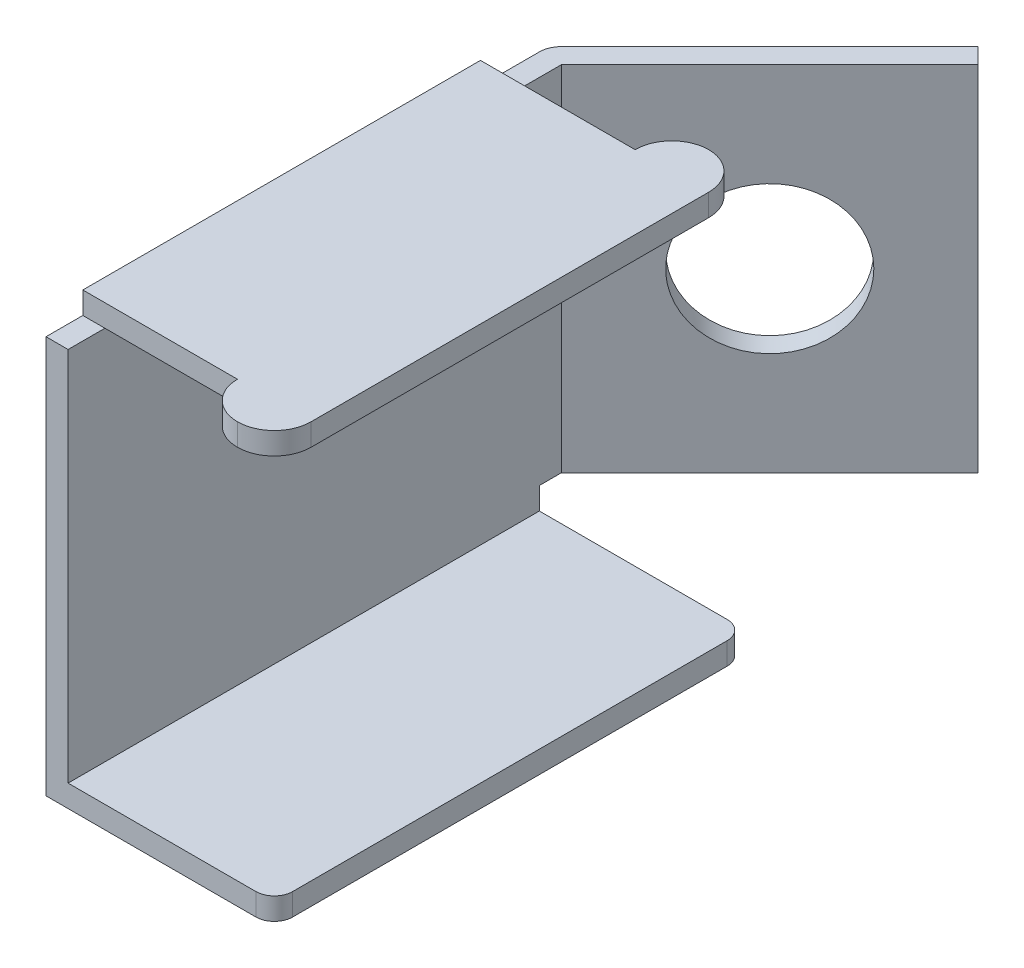
ISO-10303-21;
HEADER;
FILE_DESCRIPTION(('STEP AP214'),'2;1');
FILE_NAME('part.step','',(''),(''),'','','');
FILE_SCHEMA(('AUTOMOTIVE_DESIGN { 1 0 10303 214 1 1 1 1 }'));
ENDSEC;
DATA;
#1=APPLICATION_CONTEXT('core data for automotive mechanical design processes');
#2=APPLICATION_PROTOCOL_DEFINITION('international standard','automotive_design',2000,#1);
#3=PRODUCT_CONTEXT('',#1,'mechanical');
#4=PRODUCT('Part','Part','',(#3));
#5=PRODUCT_RELATED_PRODUCT_CATEGORY('part','',(#4));
#6=PRODUCT_DEFINITION_FORMATION('','',#4);
#7=PRODUCT_DEFINITION_CONTEXT('part definition',#1,'design');
#8=PRODUCT_DEFINITION('design','',#6,#7);
#9=PRODUCT_DEFINITION_SHAPE('','',#8);
#10=(LENGTH_UNIT() NAMED_UNIT(*) SI_UNIT(.MILLI.,.METRE.));
#11=(NAMED_UNIT(*) PLANE_ANGLE_UNIT() SI_UNIT($,.RADIAN.));
#12=(NAMED_UNIT(*) SI_UNIT($,.STERADIAN.) SOLID_ANGLE_UNIT());
#13=UNCERTAINTY_MEASURE_WITH_UNIT(LENGTH_MEASURE(1.E-05),#10,'distance_accuracy_value','');
#14=(GEOMETRIC_REPRESENTATION_CONTEXT(3) GLOBAL_UNCERTAINTY_ASSIGNED_CONTEXT((#13)) GLOBAL_UNIT_ASSIGNED_CONTEXT((#10,
#11,#12)) REPRESENTATION_CONTEXT('',''));
#15=CARTESIAN_POINT('',(0.,0.,0.));
#16=DIRECTION('',(0.,0.,1.));
#17=DIRECTION('',(1.,0.,0.));
#18=AXIS2_PLACEMENT_3D('',#15,#16,#17);
#19=CARTESIAN_POINT('',(0.,2.7,0.));
#20=DIRECTION('',(0.,1.,0.));
#21=DIRECTION('',(0.,0.,1.));
#22=AXIS2_PLACEMENT_3D('',#19,#20,#21);
#23=PLANE('',#22);
#24=DIRECTION('',(-1.,0.,0.));
#25=VECTOR('',#24,1.);
#26=CARTESIAN_POINT('',(0.,2.7,-1.35000000000001));
#27=LINE('',#26,#25);
#28=CARTESIAN_POINT('',(0.15,2.7,-1.35000000000001));
#29=VERTEX_POINT('',#28);
#30=CARTESIAN_POINT('',(0.,2.7,-1.35000000000001));
#31=VERTEX_POINT('',#30);
#32=EDGE_CURVE('E376',#29,#31,#27,.T.);
#33=ORIENTED_EDGE('',*,*,#32,.F.);
#34=DIRECTION('',(0.,0.,-1.));
#35=VECTOR('',#34,1.);
#36=CARTESIAN_POINT('',(0.15,2.7,-1.6));
#37=LINE('',#36,#35);
#38=CARTESIAN_POINT('',(0.150000000000001,2.7,-1.75000000000001));
#39=VERTEX_POINT('',#38);
#40=EDGE_CURVE('E300',#29,#39,#37,.T.);
#41=ORIENTED_EDGE('',*,*,#40,.T.);
#42=DIRECTION('',(0.707106781186551,0.,-0.707106781186544));
#43=VECTOR('',#42,1.);
#44=CARTESIAN_POINT('',(0.150000000000001,2.7,-1.75000000000001));
#45=LINE('',#44,#43);
#46=CARTESIAN_POINT('',(1.5642135623731,2.7,-3.16421356237309));
#47=VERTEX_POINT('',#46);
#48=EDGE_CURVE('E233',#39,#47,#45,.T.);
#49=ORIENTED_EDGE('',*,*,#48,.T.);
#50=DIRECTION('',(-0.707106781186543,0.,-0.707106781186552));
#51=VECTOR('',#50,1.);
#52=CARTESIAN_POINT('',(1.5642135623731,2.7,-3.16421356237309));
#53=LINE('',#52,#51);
#54=CARTESIAN_POINT('',(1.45814754519512,2.7,-3.27027957955108));
#55=VERTEX_POINT('',#54);
#56=EDGE_CURVE('E255',#47,#55,#53,.T.);
#57=ORIENTED_EDGE('',*,*,#56,.T.);
#58=DIRECTION('',(-0.707106781186551,0.,0.707106781186544));
#59=VECTOR('',#58,1.);
#60=CARTESIAN_POINT('',(1.45814754519512,2.7,-3.27027957955108));
#61=LINE('',#60,#59);
#62=CARTESIAN_POINT('',(0.0439339828220191,2.7,-1.85606601717799));
#63=VERTEX_POINT('',#62);
#64=EDGE_CURVE('E259',#55,#63,#61,.T.);
#65=ORIENTED_EDGE('',*,*,#64,.T.);
#66=CARTESIAN_POINT('',(0.150000000000002,2.7,-1.75000000000001));
#67=DIRECTION('',(0.,1.,0.));
#68=DIRECTION('',(0.,0.,1.));
#69=AXIS2_PLACEMENT_3D('',#66,#67,#68);
#70=CIRCLE('',#69,0.150000000000002);
#71=CARTESIAN_POINT('',(0.,2.7,-1.75000000000001));
#72=VERTEX_POINT('',#71);
#73=EDGE_CURVE('E239',#63,#72,#70,.T.);
#74=ORIENTED_EDGE('',*,*,#73,.T.);
#75=DIRECTION('',(0.,0.,1.));
#76=VECTOR('',#75,1.);
#77=CARTESIAN_POINT('',(0.,2.7,-1.6));
#78=LINE('',#77,#76);
#79=EDGE_CURVE('E293',#72,#31,#78,.T.);
#80=ORIENTED_EDGE('',*,*,#79,.T.);
#81=EDGE_LOOP('',(#33,#41,#49,#57,#65,#74,#80));
#82=FACE_BOUND('',#81,.T.);
#83=ADVANCED_FACE('F39',(#82),#23,.T.);
#84=CARTESIAN_POINT('',(0.,0.15,-1.60000000000001));
#85=DIRECTION('',(0.,0.,1.));
#86=DIRECTION('',(1.,0.,0.));
#87=AXIS2_PLACEMENT_3D('',#84,#85,#86);
#88=PLANE('',#87);
#89=DIRECTION('',(-1.,0.,0.));
#90=VECTOR('',#89,1.);
#91=CARTESIAN_POINT('',(0.15,0.3,-1.60000000000001));
#92=LINE('',#91,#90);
#93=CARTESIAN_POINT('',(0.15,0.3,-1.60000000000001));
#94=VERTEX_POINT('',#93);
#95=CARTESIAN_POINT('',(0.,0.3,-1.60000000000001));
#96=VERTEX_POINT('',#95);
#97=EDGE_CURVE('E269',#94,#96,#92,.T.);
#98=ORIENTED_EDGE('',*,*,#97,.F.);
#99=DIRECTION('',(0.,-1.,0.));
#100=VECTOR('',#99,1.);
#101=CARTESIAN_POINT('',(0.15,2.7,-1.6));
#102=LINE('',#101,#100);
#103=CARTESIAN_POINT('',(0.15,0.15,-1.6));
#104=VERTEX_POINT('',#103);
#105=EDGE_CURVE('E304',#94,#104,#102,.T.);
#106=ORIENTED_EDGE('',*,*,#105,.T.);
#107=DIRECTION('',(-1.,0.,0.));
#108=VECTOR('',#107,1.);
#109=CARTESIAN_POINT('',(0.,0.15,-1.60000000000001));
#110=LINE('',#109,#108);
#111=CARTESIAN_POINT('',(1.42500000000001,0.15,-1.6));
#112=VERTEX_POINT('',#111);
#113=EDGE_CURVE('E324',#112,#104,#110,.T.);
#114=ORIENTED_EDGE('',*,*,#113,.F.);
#115=DIRECTION('',(0.,-1.,0.));
#116=VECTOR('',#115,1.);
#117=CARTESIAN_POINT('',(1.42500000000001,0.15,-1.6));
#118=LINE('',#117,#116);
#119=CARTESIAN_POINT('',(1.42500000000001,0.,-1.6));
#120=VERTEX_POINT('',#119);
#121=EDGE_CURVE('E372',#112,#120,#118,.T.);
#122=ORIENTED_EDGE('',*,*,#121,.T.);
#123=DIRECTION('',(-1.,0.,0.));
#124=VECTOR('',#123,1.);
#125=CARTESIAN_POINT('',(0.,0.,-1.60000000000001));
#126=LINE('',#125,#124);
#127=CARTESIAN_POINT('',(0.,0.,-1.60000000000001));
#128=VERTEX_POINT('',#127);
#129=EDGE_CURVE('E320',#120,#128,#126,.T.);
#130=ORIENTED_EDGE('',*,*,#129,.T.);
#131=DIRECTION('',(0.,-1.,0.));
#132=VECTOR('',#131,1.);
#133=CARTESIAN_POINT('',(0.,0.15,-1.60000000000001));
#134=LINE('',#133,#132);
#135=EDGE_CURVE('E328',#96,#128,#134,.T.);
#136=ORIENTED_EDGE('',*,*,#135,.F.);
#137=EDGE_LOOP('',(#98,#106,#114,#122,#130,#136));
#138=FACE_BOUND('',#137,.T.);
#139=ADVANCED_FACE('F483',(#138),#88,.F.);
#140=CARTESIAN_POINT('',(0.,0.15,-1.60000000000001));
#141=DIRECTION('',(1.,0.,0.));
#142=DIRECTION('',(0.,0.,-1.));
#143=AXIS2_PLACEMENT_3D('',#140,#141,#142);
#144=PLANE('',#143);
#145=DIRECTION('',(0.,0.,1.));
#146=VECTOR('',#145,1.);
#147=CARTESIAN_POINT('',(0.,0.,-1.60000000000001));
#148=LINE('',#147,#146);
#149=CARTESIAN_POINT('',(0.,0.,1.60000000000001));
#150=VERTEX_POINT('',#149);
#151=EDGE_CURVE('E315',#128,#150,#148,.T.);
#152=ORIENTED_EDGE('',*,*,#151,.T.);
#153=DIRECTION('',(0.,-1.,0.));
#154=VECTOR('',#153,1.);
#155=CARTESIAN_POINT('',(0.,0.15,1.60000000000001));
#156=LINE('',#155,#154);
#157=CARTESIAN_POINT('',(0.,2.7,1.60000000000001));
#158=VERTEX_POINT('',#157);
#159=EDGE_CURVE('E345',#158,#150,#156,.T.);
#160=ORIENTED_EDGE('',*,*,#159,.F.);
#161=CARTESIAN_POINT('',(0.,2.7,1.35000000000001));
#162=VERTEX_POINT('',#161);
#163=EDGE_CURVE('E297',#162,#158,#78,.T.);
#164=ORIENTED_EDGE('',*,*,#163,.F.);
#165=DIRECTION('',(0.,-1.,0.));
#166=VECTOR('',#165,1.);
#167=CARTESIAN_POINT('',(0.,2.85,1.35000000000001));
#168=LINE('',#167,#166);
#169=CARTESIAN_POINT('',(0.,2.85,1.35000000000001));
#170=VERTEX_POINT('',#169);
#171=EDGE_CURVE('E214',#170,#162,#168,.T.);
#172=ORIENTED_EDGE('',*,*,#171,.F.);
#173=DIRECTION('',(0.,0.,1.));
#174=VECTOR('',#173,1.);
#175=CARTESIAN_POINT('',(0.,2.85,1.35000000000001));
#176=LINE('',#175,#174);
#177=CARTESIAN_POINT('',(0.,2.85,-1.35000000000001));
#178=VERTEX_POINT('',#177);
#179=EDGE_CURVE('E437',#178,#170,#176,.T.);
#180=ORIENTED_EDGE('',*,*,#179,.F.);
#181=DIRECTION('',(0.,-1.,0.));
#182=VECTOR('',#181,1.);
#183=CARTESIAN_POINT('',(0.,2.85,-1.35000000000001));
#184=LINE('',#183,#182);
#185=EDGE_CURVE('E222',#178,#31,#184,.T.);
#186=ORIENTED_EDGE('',*,*,#185,.T.);
#187=ORIENTED_EDGE('',*,*,#79,.F.);
#188=DIRECTION('',(0.,1.,0.));
#189=VECTOR('',#188,1.);
#190=CARTESIAN_POINT('',(0.,2.7,-1.75000000000001));
#191=LINE('',#190,#189);
#192=CARTESIAN_POINT('',(0.,0.3,-1.75000000000001));
#193=VERTEX_POINT('',#192);
#194=EDGE_CURVE('E279',#193,#72,#191,.T.);
#195=ORIENTED_EDGE('',*,*,#194,.F.);
#196=DIRECTION('',(0.,0.,1.));
#197=VECTOR('',#196,1.);
#198=CARTESIAN_POINT('',(0.,0.3,-1.75000000000001));
#199=LINE('',#198,#197);
#200=EDGE_CURVE('E283',#193,#96,#199,.T.);
#201=ORIENTED_EDGE('',*,*,#200,.T.);
#202=ORIENTED_EDGE('',*,*,#135,.T.);
#203=EDGE_LOOP('',(#152,#160,#164,#172,#180,#186,#187,#195,#201,#202));
#204=FACE_BOUND('',#203,.T.);
#205=ADVANCED_FACE('F446',(#204),#144,.F.);
#206=CARTESIAN_POINT('',(0.,0.15,1.60000000000001));
#207=DIRECTION('',(0.,0.,-1.));
#208=DIRECTION('',(-1.,0.,0.));
#209=AXIS2_PLACEMENT_3D('',#206,#207,#208);
#210=PLANE('',#209);
#211=DIRECTION('',(1.,0.,0.));
#212=VECTOR('',#211,1.);
#213=CARTESIAN_POINT('',(0.,0.,1.60000000000001));
#214=LINE('',#213,#212);
#215=CARTESIAN_POINT('',(1.425,0.,1.6));
#216=VERTEX_POINT('',#215);
#217=EDGE_CURVE('E332',#150,#216,#214,.T.);
#218=ORIENTED_EDGE('',*,*,#217,.T.);
#219=DIRECTION('',(0.,-1.,0.));
#220=VECTOR('',#219,1.);
#221=CARTESIAN_POINT('',(1.425,0.15,1.6));
#222=LINE('',#221,#220);
#223=CARTESIAN_POINT('',(1.425,0.15,1.6));
#224=VERTEX_POINT('',#223);
#225=EDGE_CURVE('E362',#216,#224,#222,.F.);
#226=ORIENTED_EDGE('',*,*,#225,.T.);
#227=DIRECTION('',(1.,0.,0.));
#228=VECTOR('',#227,1.);
#229=CARTESIAN_POINT('',(0.,0.15,1.60000000000001));
#230=LINE('',#229,#228);
#231=CARTESIAN_POINT('',(0.15,0.15,1.60000000000001));
#232=VERTEX_POINT('',#231);
#233=EDGE_CURVE('E316',#232,#224,#230,.T.);
#234=ORIENTED_EDGE('',*,*,#233,.F.);
#235=DIRECTION('',(0.,-1.,0.));
#236=VECTOR('',#235,1.);
#237=CARTESIAN_POINT('',(0.15,2.7,1.60000000000001));
#238=LINE('',#237,#236);
#239=CARTESIAN_POINT('',(0.15,2.7,1.60000000000001));
#240=VERTEX_POINT('',#239);
#241=EDGE_CURVE('E311',#240,#232,#238,.T.);
#242=ORIENTED_EDGE('',*,*,#241,.F.);
#243=DIRECTION('',(1.,0.,0.));
#244=VECTOR('',#243,1.);
#245=CARTESIAN_POINT('',(0.,2.7,1.60000000000001));
#246=LINE('',#245,#244);
#247=EDGE_CURVE('E296',#158,#240,#246,.T.);
#248=ORIENTED_EDGE('',*,*,#247,.F.);
#249=ORIENTED_EDGE('',*,*,#159,.T.);
#250=EDGE_LOOP('',(#218,#226,#234,#242,#248,#249));
#251=FACE_BOUND('',#250,.T.);
#252=ADVANCED_FACE('F493',(#251),#210,.F.);
#253=CARTESIAN_POINT('',(1.55000000000001,0.15,-1.6));
#254=DIRECTION('',(-1.,0.,0.));
#255=DIRECTION('',(0.,0.,1.));
#256=AXIS2_PLACEMENT_3D('',#253,#254,#255);
#257=PLANE('',#256);
#258=DIRECTION('',(0.,0.,-1.));
#259=VECTOR('',#258,1.);
#260=CARTESIAN_POINT('',(1.55000000000001,0.15,-1.6));
#261=LINE('',#260,#259);
#262=CARTESIAN_POINT('',(1.55,0.15,1.475));
#263=VERTEX_POINT('',#262);
#264=CARTESIAN_POINT('',(1.55000000000001,0.15,-1.475));
#265=VERTEX_POINT('',#264);
#266=EDGE_CURVE('E319',#263,#265,#261,.T.);
#267=ORIENTED_EDGE('',*,*,#266,.F.);
#268=DIRECTION('',(0.,-1.,0.));
#269=VECTOR('',#268,1.);
#270=CARTESIAN_POINT('',(1.55,0.15,1.475));
#271=LINE('',#270,#269);
#272=CARTESIAN_POINT('',(1.55,0.,1.475));
#273=VERTEX_POINT('',#272);
#274=EDGE_CURVE('E352',#263,#273,#271,.T.);
#275=ORIENTED_EDGE('',*,*,#274,.T.);
#276=DIRECTION('',(0.,0.,-1.));
#277=VECTOR('',#276,1.);
#278=CARTESIAN_POINT('',(1.55000000000001,0.,-1.6));
#279=LINE('',#278,#277);
#280=CARTESIAN_POINT('',(1.55000000000001,0.,-1.475));
#281=VERTEX_POINT('',#280);
#282=EDGE_CURVE('E336',#273,#281,#279,.T.);
#283=ORIENTED_EDGE('',*,*,#282,.T.);
#284=DIRECTION('',(0.,-1.,0.));
#285=VECTOR('',#284,1.);
#286=CARTESIAN_POINT('',(1.55000000000001,0.15,-1.475));
#287=LINE('',#286,#285);
#288=EDGE_CURVE('E349',#281,#265,#287,.F.);
#289=ORIENTED_EDGE('',*,*,#288,.T.);
#290=EDGE_LOOP('',(#267,#275,#283,#289));
#291=FACE_BOUND('',#290,.T.);
#292=ADVANCED_FACE('F507',(#291),#257,.F.);
#293=CARTESIAN_POINT('',(0.,0.15,0.));
#294=DIRECTION('',(0.,1.,0.));
#295=DIRECTION('',(0.,0.,1.));
#296=AXIS2_PLACEMENT_3D('',#293,#294,#295);
#297=PLANE('',#296);
#298=DIRECTION('',(0.,0.,-1.));
#299=VECTOR('',#298,1.);
#300=CARTESIAN_POINT('',(0.15,0.15,-1.6));
#301=LINE('',#300,#299);
#302=EDGE_CURVE('E292',#232,#104,#301,.T.);
#303=ORIENTED_EDGE('',*,*,#302,.F.);
#304=ORIENTED_EDGE('',*,*,#233,.T.);
#305=CARTESIAN_POINT('',(1.425,0.15,1.475));
#306=DIRECTION('',(0.,1.,0.));
#307=DIRECTION('',(0.,0.,1.));
#308=AXIS2_PLACEMENT_3D('',#305,#306,#307);
#309=CIRCLE('',#308,0.125);
#310=EDGE_CURVE('E369',#224,#263,#309,.T.);
#311=ORIENTED_EDGE('',*,*,#310,.T.);
#312=ORIENTED_EDGE('',*,*,#266,.T.);
#313=CARTESIAN_POINT('',(1.42500000000001,0.15,-1.475));
#314=DIRECTION('',(0.,1.,0.));
#315=DIRECTION('',(0.,0.,1.));
#316=AXIS2_PLACEMENT_3D('',#313,#314,#315);
#317=CIRCLE('',#316,0.125);
#318=EDGE_CURVE('E366',#265,#112,#317,.T.);
#319=ORIENTED_EDGE('',*,*,#318,.T.);
#320=ORIENTED_EDGE('',*,*,#113,.T.);
#321=EDGE_LOOP('',(#303,#304,#311,#312,#319,#320));
#322=FACE_BOUND('',#321,.T.);
#323=ADVANCED_FACE('F499',(#322),#297,.T.);
#324=CARTESIAN_POINT('',(0.,0.,0.));
#325=DIRECTION('',(0.,1.,0.));
#326=DIRECTION('',(0.,0.,1.));
#327=AXIS2_PLACEMENT_3D('',#324,#325,#326);
#328=PLANE('',#327);
#329=ORIENTED_EDGE('',*,*,#282,.F.);
#330=CARTESIAN_POINT('',(1.425,0.,1.475));
#331=DIRECTION('',(0.,1.,0.));
#332=DIRECTION('',(0.,0.,1.));
#333=AXIS2_PLACEMENT_3D('',#330,#331,#332);
#334=CIRCLE('',#333,0.125);
#335=EDGE_CURVE('E359',#273,#216,#334,.F.);
#336=ORIENTED_EDGE('',*,*,#335,.T.);
#337=ORIENTED_EDGE('',*,*,#217,.F.);
#338=ORIENTED_EDGE('',*,*,#151,.F.);
#339=ORIENTED_EDGE('',*,*,#129,.F.);
#340=CARTESIAN_POINT('',(1.42500000000001,0.,-1.475));
#341=DIRECTION('',(0.,1.,0.));
#342=DIRECTION('',(0.,0.,1.));
#343=AXIS2_PLACEMENT_3D('',#340,#341,#342);
#344=CIRCLE('',#343,0.125);
#345=EDGE_CURVE('E356',#120,#281,#344,.F.);
#346=ORIENTED_EDGE('',*,*,#345,.T.);
#347=EDGE_LOOP('',(#329,#336,#337,#338,#339,#346));
#348=FACE_BOUND('',#347,.T.);
#349=ADVANCED_FACE('F490',(#348),#328,.F.);
#350=CARTESIAN_POINT('',(1.425,0.15,1.475));
#351=DIRECTION('',(0.,-1.,0.));
#352=DIRECTION('',(0.,0.,-1.));
#353=AXIS2_PLACEMENT_3D('',#350,#351,#352);
#354=CYLINDRICAL_SURFACE('',#353,0.125);
#355=ORIENTED_EDGE('',*,*,#310,.F.);
#356=ORIENTED_EDGE('',*,*,#225,.F.);
#357=ORIENTED_EDGE('',*,*,#335,.F.);
#358=ORIENTED_EDGE('',*,*,#274,.F.);
#359=EDGE_LOOP('',(#355,#356,#357,#358));
#360=FACE_BOUND('',#359,.T.);
#361=ADVANCED_FACE('F503',(#360),#354,.T.);
#362=CARTESIAN_POINT('',(1.42500000000001,0.15,-1.475));
#363=DIRECTION('',(0.,-1.,0.));
#364=DIRECTION('',(0.,0.,-1.));
#365=AXIS2_PLACEMENT_3D('',#362,#363,#364);
#366=CYLINDRICAL_SURFACE('',#365,0.125);
#367=ORIENTED_EDGE('',*,*,#318,.F.);
#368=ORIENTED_EDGE('',*,*,#288,.F.);
#369=ORIENTED_EDGE('',*,*,#345,.F.);
#370=ORIENTED_EDGE('',*,*,#121,.F.);
#371=EDGE_LOOP('',(#367,#368,#369,#370));
#372=FACE_BOUND('',#371,.T.);
#373=ADVANCED_FACE('F510',(#372),#366,.T.);
#374=CARTESIAN_POINT('',(0.15,2.7,-1.6));
#375=DIRECTION('',(-1.,0.,0.));
#376=DIRECTION('',(0.,0.,1.));
#377=AXIS2_PLACEMENT_3D('',#374,#375,#376);
#378=PLANE('',#377);
#379=ORIENTED_EDGE('',*,*,#302,.T.);
#380=ORIENTED_EDGE('',*,*,#105,.F.);
#381=DIRECTION('',(0.,0.,1.));
#382=VECTOR('',#381,1.);
#383=CARTESIAN_POINT('',(0.15,0.3,-1.75000000000001));
#384=LINE('',#383,#382);
#385=CARTESIAN_POINT('',(0.15,0.3,-1.75000000000001));
#386=VERTEX_POINT('',#385);
#387=EDGE_CURVE('E289',#386,#94,#384,.T.);
#388=ORIENTED_EDGE('',*,*,#387,.F.);
#389=DIRECTION('',(0.,-1.,0.));
#390=VECTOR('',#389,1.);
#391=CARTESIAN_POINT('',(0.150000000000001,2.7,-1.75000000000001));
#392=LINE('',#391,#390);
#393=EDGE_CURVE('E275',#39,#386,#392,.T.);
#394=ORIENTED_EDGE('',*,*,#393,.F.);
#395=ORIENTED_EDGE('',*,*,#40,.F.);
#396=CARTESIAN_POINT('',(0.15,2.7,1.35000000000001));
#397=VERTEX_POINT('',#396);
#398=EDGE_CURVE('E305',#397,#29,#37,.T.);
#399=ORIENTED_EDGE('',*,*,#398,.F.);
#400=EDGE_CURVE('E301',#240,#397,#37,.T.);
#401=ORIENTED_EDGE('',*,*,#400,.F.);
#402=ORIENTED_EDGE('',*,*,#241,.T.);
#403=EDGE_LOOP('',(#379,#380,#388,#394,#395,#399,#401,#402));
#404=FACE_BOUND('',#403,.T.);
#405=ADVANCED_FACE('F464',(#404),#378,.F.);
#406=DIRECTION('',(1.,0.,0.));
#407=VECTOR('',#406,1.);
#408=CARTESIAN_POINT('',(0.,2.7,1.35000000000001));
#409=LINE('',#408,#407);
#410=EDGE_CURVE('E206',#162,#397,#409,.T.);
#411=ORIENTED_EDGE('',*,*,#410,.F.);
#412=ORIENTED_EDGE('',*,*,#163,.T.);
#413=ORIENTED_EDGE('',*,*,#247,.T.);
#414=ORIENTED_EDGE('',*,*,#400,.T.);
#415=EDGE_LOOP('',(#411,#412,#413,#414));
#416=FACE_BOUND('',#415,.T.);
#417=ADVANCED_FACE('F497',(#416),#23,.T.);
#418=CARTESIAN_POINT('',(0.15,0.3,-1.75000000000001));
#419=DIRECTION('',(0.,1.,0.));
#420=DIRECTION('',(0.,0.,1.));
#421=AXIS2_PLACEMENT_3D('',#418,#419,#420);
#422=PLANE('',#421);
#423=ORIENTED_EDGE('',*,*,#97,.T.);
#424=ORIENTED_EDGE('',*,*,#200,.F.);
#425=CARTESIAN_POINT('',(0.150000000000002,0.3,-1.75000000000001));
#426=DIRECTION('',(0.,1.,0.));
#427=DIRECTION('',(0.,0.,1.));
#428=AXIS2_PLACEMENT_3D('',#425,#426,#427);
#429=CIRCLE('',#428,0.150000000000002);
#430=CARTESIAN_POINT('',(0.0439339828220191,0.3,-1.85606601717799));
#431=VERTEX_POINT('',#430);
#432=EDGE_CURVE('E247',#431,#193,#429,.T.);
#433=ORIENTED_EDGE('',*,*,#432,.F.);
#434=DIRECTION('',(-0.707106781186551,0.,0.707106781186544));
#435=VECTOR('',#434,1.);
#436=CARTESIAN_POINT('',(1.45814754519512,0.3,-3.27027957955108));
#437=LINE('',#436,#435);
#438=CARTESIAN_POINT('',(1.45814754519512,0.3,-3.27027957955108));
#439=VERTEX_POINT('',#438);
#440=EDGE_CURVE('E243',#439,#431,#437,.T.);
#441=ORIENTED_EDGE('',*,*,#440,.F.);
#442=DIRECTION('',(-0.707106781186543,0.,-0.707106781186552));
#443=VECTOR('',#442,1.);
#444=CARTESIAN_POINT('',(1.5642135623731,0.3,-3.16421356237309));
#445=LINE('',#444,#443);
#446=CARTESIAN_POINT('',(1.5642135623731,0.3,-3.16421356237309));
#447=VERTEX_POINT('',#446);
#448=EDGE_CURVE('E238',#447,#439,#445,.T.);
#449=ORIENTED_EDGE('',*,*,#448,.F.);
#450=DIRECTION('',(0.707106781186551,0.,-0.707106781186544));
#451=VECTOR('',#450,1.);
#452=CARTESIAN_POINT('',(0.150000000000001,0.3,-1.75000000000001));
#453=LINE('',#452,#451);
#454=EDGE_CURVE('E234',#386,#447,#453,.T.);
#455=ORIENTED_EDGE('',*,*,#454,.F.);
#456=ORIENTED_EDGE('',*,*,#387,.T.);
#457=EDGE_LOOP('',(#423,#424,#433,#441,#449,#455,#456));
#458=FACE_BOUND('',#457,.T.);
#459=ADVANCED_FACE('F528',(#458),#422,.F.);
#460=CARTESIAN_POINT('',(0.150000000000002,0.3,-1.75000000000001));
#461=DIRECTION('',(0.,1.,0.));
#462=DIRECTION('',(0.,0.,1.));
#463=AXIS2_PLACEMENT_3D('',#460,#461,#462);
#464=CYLINDRICAL_SURFACE('',#463,0.150000000000002);
#465=ORIENTED_EDGE('',*,*,#73,.F.);
#466=DIRECTION('',(0.,1.,0.));
#467=VECTOR('',#466,1.);
#468=CARTESIAN_POINT('',(0.0439339828220191,0.3,-1.85606601717799));
#469=LINE('',#468,#467);
#470=EDGE_CURVE('E266',#431,#63,#469,.T.);
#471=ORIENTED_EDGE('',*,*,#470,.F.);
#472=ORIENTED_EDGE('',*,*,#432,.T.);
#473=ORIENTED_EDGE('',*,*,#194,.T.);
#474=EDGE_LOOP('',(#465,#471,#472,#473));
#475=FACE_BOUND('',#474,.T.);
#476=ADVANCED_FACE('F477',(#475),#464,.T.);
#477=CARTESIAN_POINT('',(1.45814754519512,0.3,-3.27027957955108));
#478=DIRECTION('',(-0.707106781186544,0.,-0.707106781186551));
#479=DIRECTION('',(-0.707106781186551,0.,0.707106781186544));
#480=AXIS2_PLACEMENT_3D('',#477,#478,#479);
#481=PLANE('',#480);
#482=CARTESIAN_POINT('',(0.75104076400857,1.5,-2.56317279836453));
#483=DIRECTION('',(-0.707106781186544,0.,-0.707106781186551));
#484=DIRECTION('',(-0.707106781186551,0.,0.707106781186544));
#485=AXIS2_PLACEMENT_3D('',#482,#483,#484);
#486=CIRCLE('',#485,0.499999999999999);
#487=CARTESIAN_POINT('',(0.397487373415295,1.5,-2.20961940777126));
#488=VERTEX_POINT('',#487);
#489=EDGE_CURVE('E229',#488,#488,#486,.T.);
#490=ORIENTED_EDGE('',*,*,#489,.F.);
#491=EDGE_LOOP('',(#490));
#492=FACE_BOUND('',#491,.T.);
#493=ORIENTED_EDGE('',*,*,#64,.F.);
#494=DIRECTION('',(0.,1.,0.));
#495=VECTOR('',#494,1.);
#496=CARTESIAN_POINT('',(1.45814754519512,0.3,-3.27027957955108));
#497=LINE('',#496,#495);
#498=EDGE_CURVE('E270',#439,#55,#497,.T.);
#499=ORIENTED_EDGE('',*,*,#498,.F.);
#500=ORIENTED_EDGE('',*,*,#440,.T.);
#501=ORIENTED_EDGE('',*,*,#470,.T.);
#502=EDGE_LOOP('',(#493,#499,#500,#501));
#503=FACE_BOUND('',#502,.T.);
#504=ADVANCED_FACE('F535',(#492,#503),#481,.T.);
#505=CARTESIAN_POINT('',(1.5642135623731,0.3,-3.16421356237309));
#506=DIRECTION('',(0.707106781186552,0.,-0.707106781186543));
#507=DIRECTION('',(-0.707106781186543,0.,-0.707106781186552));
#508=AXIS2_PLACEMENT_3D('',#505,#506,#507);
#509=PLANE('',#508);
#510=ORIENTED_EDGE('',*,*,#56,.F.);
#511=DIRECTION('',(0.,1.,0.));
#512=VECTOR('',#511,1.);
#513=CARTESIAN_POINT('',(1.5642135623731,0.3,-3.16421356237309));
#514=LINE('',#513,#512);
#515=EDGE_CURVE('E251',#447,#47,#514,.T.);
#516=ORIENTED_EDGE('',*,*,#515,.F.);
#517=ORIENTED_EDGE('',*,*,#448,.T.);
#518=ORIENTED_EDGE('',*,*,#498,.T.);
#519=EDGE_LOOP('',(#510,#516,#517,#518));
#520=FACE_BOUND('',#519,.T.);
#521=ADVANCED_FACE('F472',(#520),#509,.T.);
#522=CARTESIAN_POINT('',(0.150000000000001,0.3,-1.75000000000001));
#523=DIRECTION('',(0.707106781186544,0.,0.707106781186551));
#524=DIRECTION('',(0.707106781186551,0.,-0.707106781186544));
#525=AXIS2_PLACEMENT_3D('',#522,#523,#524);
#526=PLANE('',#525);
#527=CARTESIAN_POINT('',(0.857106781186552,1.5,-2.45710678118655));
#528=DIRECTION('',(0.707106781186544,0.,0.707106781186551));
#529=DIRECTION('',(0.707106781186551,0.,-0.707106781186544));
#530=AXIS2_PLACEMENT_3D('',#527,#528,#529);
#531=CIRCLE('',#530,0.499999999999999);
#532=CARTESIAN_POINT('',(1.21066017177983,1.5,-2.81066017177982));
#533=VERTEX_POINT('',#532);
#534=EDGE_CURVE('E219',#533,#533,#531,.T.);
#535=ORIENTED_EDGE('',*,*,#534,.F.);
#536=EDGE_LOOP('',(#535));
#537=FACE_BOUND('',#536,.T.);
#538=ORIENTED_EDGE('',*,*,#48,.F.);
#539=ORIENTED_EDGE('',*,*,#393,.T.);
#540=ORIENTED_EDGE('',*,*,#454,.T.);
#541=ORIENTED_EDGE('',*,*,#515,.T.);
#542=EDGE_LOOP('',(#538,#539,#540,#541));
#543=FACE_BOUND('',#542,.T.);
#544=ADVANCED_FACE('F468',(#537,#543),#526,.T.);
#545=CARTESIAN_POINT('',(0.021966991411017,1.5,-3.29224657096209));
#546=DIRECTION('',(0.707106781186544,0.,0.707106781186551));
#547=DIRECTION('',(0.707106781186551,0.,-0.707106781186544));
#548=AXIS2_PLACEMENT_3D('',#545,#546,#547);
#549=CYLINDRICAL_SURFACE('',#548,0.499999999999999);
#550=ORIENTED_EDGE('',*,*,#489,.T.);
#551=EDGE_LOOP('',(#550));
#552=FACE_BOUND('',#551,.T.);
#553=ORIENTED_EDGE('',*,*,#534,.T.);
#554=EDGE_LOOP('',(#553));
#555=FACE_BOUND('',#554,.T.);
#556=ADVANCED_FACE('F540',(#552,#555),#549,.F.);
#557=CARTESIAN_POINT('',(0.,2.85,1.35000000000001));
#558=DIRECTION('',(0.,0.,-1.));
#559=DIRECTION('',(-1.,0.,0.));
#560=AXIS2_PLACEMENT_3D('',#557,#558,#559);
#561=PLANE('',#560);
#562=ORIENTED_EDGE('',*,*,#410,.T.);
#563=CARTESIAN_POINT('',(1.05,2.7,1.35000000000001));
#564=VERTEX_POINT('',#563);
#565=EDGE_CURVE('E194',#397,#564,#409,.T.);
#566=ORIENTED_EDGE('',*,*,#565,.T.);
#567=DIRECTION('',(0.,-1.,0.));
#568=VECTOR('',#567,1.);
#569=CARTESIAN_POINT('',(1.05,2.85,1.35000000000001));
#570=LINE('',#569,#568);
#571=CARTESIAN_POINT('',(1.05,2.85,1.35000000000001));
#572=VERTEX_POINT('',#571);
#573=EDGE_CURVE('E204',#572,#564,#570,.T.);
#574=ORIENTED_EDGE('',*,*,#573,.F.);
#575=DIRECTION('',(1.,0.,0.));
#576=VECTOR('',#575,1.);
#577=CARTESIAN_POINT('',(0.,2.85,1.35000000000001));
#578=LINE('',#577,#576);
#579=EDGE_CURVE('E431',#170,#572,#578,.T.);
#580=ORIENTED_EDGE('',*,*,#579,.F.);
#581=ORIENTED_EDGE('',*,*,#171,.T.);
#582=EDGE_LOOP('',(#562,#566,#574,#580,#581));
#583=FACE_BOUND('',#582,.T.);
#584=ADVANCED_FACE('F203',(#583),#561,.F.);
#585=CARTESIAN_POINT('',(0.,2.85,-1.35000000000001));
#586=DIRECTION('',(0.,0.,1.));
#587=DIRECTION('',(1.,0.,0.));
#588=AXIS2_PLACEMENT_3D('',#585,#586,#587);
#589=PLANE('',#588);
#590=CARTESIAN_POINT('',(1.05,2.7,-1.35000000000001));
#591=VERTEX_POINT('',#590);
#592=EDGE_CURVE('E434',#591,#29,#27,.T.);
#593=ORIENTED_EDGE('',*,*,#592,.T.);
#594=ORIENTED_EDGE('',*,*,#32,.T.);
#595=ORIENTED_EDGE('',*,*,#185,.F.);
#596=DIRECTION('',(-1.,0.,0.));
#597=VECTOR('',#596,1.);
#598=CARTESIAN_POINT('',(0.,2.85,-1.35000000000001));
#599=LINE('',#598,#597);
#600=CARTESIAN_POINT('',(1.05,2.85,-1.35000000000001));
#601=VERTEX_POINT('',#600);
#602=EDGE_CURVE('E421',#601,#178,#599,.T.);
#603=ORIENTED_EDGE('',*,*,#602,.F.);
#604=DIRECTION('',(0.,-1.,0.));
#605=VECTOR('',#604,1.);
#606=CARTESIAN_POINT('',(1.05,2.85,-1.35000000000001));
#607=LINE('',#606,#605);
#608=EDGE_CURVE('E215',#601,#591,#607,.T.);
#609=ORIENTED_EDGE('',*,*,#608,.T.);
#610=EDGE_LOOP('',(#593,#594,#595,#603,#609));
#611=FACE_BOUND('',#610,.T.);
#612=ADVANCED_FACE('F426',(#611),#589,.F.);
#613=CARTESIAN_POINT('',(0.,2.85,0.));
#614=DIRECTION('',(0.,-1.,0.));
#615=DIRECTION('',(0.,0.,-1.));
#616=AXIS2_PLACEMENT_3D('',#613,#614,#615);
#617=PLANE('',#616);
#618=CARTESIAN_POINT('',(1.3,2.85,-1.35));
#619=DIRECTION('',(0.,-1.,0.));
#620=DIRECTION('',(0.,0.,-1.));
#621=AXIS2_PLACEMENT_3D('',#618,#619,#620);
#622=CIRCLE('',#621,0.25);
#623=CARTESIAN_POINT('',(1.55,2.85,-1.35));
#624=VERTEX_POINT('',#623);
#625=CARTESIAN_POINT('',(1.3,2.85,-1.6));
#626=VERTEX_POINT('',#625);
#627=EDGE_CURVE('E382',#624,#626,#622,.F.);
#628=ORIENTED_EDGE('',*,*,#627,.T.);
#629=CARTESIAN_POINT('',(1.3,2.85,-1.35));
#630=DIRECTION('',(0.,-1.,0.));
#631=DIRECTION('',(0.,0.,-1.));
#632=AXIS2_PLACEMENT_3D('',#629,#630,#631);
#633=CIRCLE('',#632,0.25);
#634=EDGE_CURVE('E385',#626,#601,#633,.F.);
#635=ORIENTED_EDGE('',*,*,#634,.T.);
#636=ORIENTED_EDGE('',*,*,#602,.T.);
#637=ORIENTED_EDGE('',*,*,#179,.T.);
#638=ORIENTED_EDGE('',*,*,#579,.T.);
#639=CARTESIAN_POINT('',(1.3,2.85,1.35000000000001));
#640=DIRECTION('',(0.,-1.,0.));
#641=DIRECTION('',(0.,0.,-1.));
#642=AXIS2_PLACEMENT_3D('',#639,#640,#641);
#643=CIRCLE('',#642,0.25);
#644=CARTESIAN_POINT('',(1.3,2.85,1.60000000000001));
#645=VERTEX_POINT('',#644);
#646=EDGE_CURVE('E211',#572,#645,#643,.F.);
#647=ORIENTED_EDGE('',*,*,#646,.T.);
#648=CARTESIAN_POINT('',(1.3,2.85,1.35000000000001));
#649=DIRECTION('',(0.,-1.,0.));
#650=DIRECTION('',(0.,0.,-1.));
#651=AXIS2_PLACEMENT_3D('',#648,#649,#650);
#652=CIRCLE('',#651,0.25);
#653=CARTESIAN_POINT('',(1.55,2.85,1.35000000000001));
#654=VERTEX_POINT('',#653);
#655=EDGE_CURVE('E377',#645,#654,#652,.F.);
#656=ORIENTED_EDGE('',*,*,#655,.T.);
#657=DIRECTION('',(0.,0.,-1.));
#658=VECTOR('',#657,1.);
#659=CARTESIAN_POINT('',(1.55,2.85,1.60000000000001));
#660=LINE('',#659,#658);
#661=EDGE_CURVE('E399',#654,#624,#660,.T.);
#662=ORIENTED_EDGE('',*,*,#661,.T.);
#663=EDGE_LOOP('',(#628,#635,#636,#637,#638,#647,#656,#662));
#664=FACE_BOUND('',#663,.T.);
#665=ADVANCED_FACE('F412',(#664),#617,.F.);
#666=CARTESIAN_POINT('',(0.,2.7,0.));
#667=DIRECTION('',(0.,-1.,0.));
#668=DIRECTION('',(0.,0.,-1.));
#669=AXIS2_PLACEMENT_3D('',#666,#667,#668);
#670=PLANE('',#669);
#671=ORIENTED_EDGE('',*,*,#592,.F.);
#672=CARTESIAN_POINT('',(1.3,2.7,-1.35));
#673=DIRECTION('',(0.,-1.,0.));
#674=DIRECTION('',(0.,0.,-1.));
#675=AXIS2_PLACEMENT_3D('',#672,#673,#674);
#676=CIRCLE('',#675,0.25);
#677=CARTESIAN_POINT('',(1.3,2.7,-1.6));
#678=VERTEX_POINT('',#677);
#679=EDGE_CURVE('E392',#591,#678,#676,.T.);
#680=ORIENTED_EDGE('',*,*,#679,.T.);
#681=CARTESIAN_POINT('',(1.3,2.7,-1.35));
#682=DIRECTION('',(0.,-1.,0.));
#683=DIRECTION('',(0.,0.,-1.));
#684=AXIS2_PLACEMENT_3D('',#681,#682,#683);
#685=CIRCLE('',#684,0.25);
#686=CARTESIAN_POINT('',(1.55,2.7,-1.35));
#687=VERTEX_POINT('',#686);
#688=EDGE_CURVE('E63',#678,#687,#685,.T.);
#689=ORIENTED_EDGE('',*,*,#688,.T.);
#690=DIRECTION('',(0.,0.,-1.));
#691=VECTOR('',#690,1.);
#692=CARTESIAN_POINT('',(1.55,2.7,1.60000000000001));
#693=LINE('',#692,#691);
#694=CARTESIAN_POINT('',(1.55,2.7,1.35000000000001));
#695=VERTEX_POINT('',#694);
#696=EDGE_CURVE('E208',#695,#687,#693,.T.);
#697=ORIENTED_EDGE('',*,*,#696,.F.);
#698=CARTESIAN_POINT('',(1.3,2.7,1.35000000000001));
#699=DIRECTION('',(0.,-1.,0.));
#700=DIRECTION('',(0.,0.,-1.));
#701=AXIS2_PLACEMENT_3D('',#698,#699,#700);
#702=CIRCLE('',#701,0.25);
#703=CARTESIAN_POINT('',(1.3,2.7,1.60000000000001));
#704=VERTEX_POINT('',#703);
#705=EDGE_CURVE('E57',#695,#704,#702,.T.);
#706=ORIENTED_EDGE('',*,*,#705,.T.);
#707=CARTESIAN_POINT('',(1.3,2.7,1.35000000000001));
#708=DIRECTION('',(0.,-1.,0.));
#709=DIRECTION('',(0.,0.,-1.));
#710=AXIS2_PLACEMENT_3D('',#707,#708,#709);
#711=CIRCLE('',#710,0.25);
#712=EDGE_CURVE('E189',#704,#564,#711,.T.);
#713=ORIENTED_EDGE('',*,*,#712,.T.);
#714=ORIENTED_EDGE('',*,*,#565,.F.);
#715=ORIENTED_EDGE('',*,*,#398,.T.);
#716=EDGE_LOOP('',(#671,#680,#689,#697,#706,#713,#714,#715));
#717=FACE_BOUND('',#716,.T.);
#718=ADVANCED_FACE('F192',(#717),#670,.T.);
#719=CARTESIAN_POINT('',(1.55,2.7,1.60000000000001));
#720=DIRECTION('',(1.,0.,0.));
#721=DIRECTION('',(0.,0.,-1.));
#722=AXIS2_PLACEMENT_3D('',#719,#720,#721);
#723=PLANE('',#722);
#724=ORIENTED_EDGE('',*,*,#696,.T.);
#725=DIRECTION('',(0.,1.,0.));
#726=VECTOR('',#725,1.);
#727=CARTESIAN_POINT('',(1.55,2.7,-1.35));
#728=LINE('',#727,#726);
#729=EDGE_CURVE('E11',#687,#624,#728,.T.);
#730=ORIENTED_EDGE('',*,*,#729,.T.);
#731=ORIENTED_EDGE('',*,*,#661,.F.);
#732=DIRECTION('',(0.,1.,0.));
#733=VECTOR('',#732,1.);
#734=CARTESIAN_POINT('',(1.55,2.7,1.35000000000001));
#735=LINE('',#734,#733);
#736=EDGE_CURVE('E49',#654,#695,#735,.F.);
#737=ORIENTED_EDGE('',*,*,#736,.T.);
#738=EDGE_LOOP('',(#724,#730,#731,#737));
#739=FACE_BOUND('',#738,.T.);
#740=ADVANCED_FACE('F415',(#739),#723,.T.);
#741=CARTESIAN_POINT('',(1.3,2.7,-1.35));
#742=DIRECTION('',(0.,1.,0.));
#743=DIRECTION('',(0.,0.,1.));
#744=AXIS2_PLACEMENT_3D('',#741,#742,#743);
#745=CYLINDRICAL_SURFACE('',#744,0.25);
#746=ORIENTED_EDGE('',*,*,#729,.F.);
#747=ORIENTED_EDGE('',*,*,#688,.F.);
#748=DIRECTION('',(0.,1.,0.));
#749=VECTOR('',#748,1.);
#750=CARTESIAN_POINT('',(1.3,2.7,-1.6));
#751=LINE('',#750,#749);
#752=EDGE_CURVE('E396',#626,#678,#751,.F.);
#753=ORIENTED_EDGE('',*,*,#752,.F.);
#754=ORIENTED_EDGE('',*,*,#627,.F.);
#755=EDGE_LOOP('',(#746,#747,#753,#754));
#756=FACE_BOUND('',#755,.T.);
#757=ADVANCED_FACE('F418',(#756),#745,.T.);
#758=CARTESIAN_POINT('',(1.3,2.7,-1.35));
#759=DIRECTION('',(0.,1.,0.));
#760=DIRECTION('',(0.,0.,1.));
#761=AXIS2_PLACEMENT_3D('',#758,#759,#760);
#762=CYLINDRICAL_SURFACE('',#761,0.25);
#763=ORIENTED_EDGE('',*,*,#679,.F.);
#764=ORIENTED_EDGE('',*,*,#608,.F.);
#765=ORIENTED_EDGE('',*,*,#634,.F.);
#766=ORIENTED_EDGE('',*,*,#752,.T.);
#767=EDGE_LOOP('',(#763,#764,#765,#766));
#768=FACE_BOUND('',#767,.T.);
#769=ADVANCED_FACE('F433',(#768),#762,.T.);
#770=CARTESIAN_POINT('',(1.3,2.7,1.35000000000001));
#771=DIRECTION('',(0.,1.,0.));
#772=DIRECTION('',(0.,0.,1.));
#773=AXIS2_PLACEMENT_3D('',#770,#771,#772);
#774=CYLINDRICAL_SURFACE('',#773,0.25);
#775=DIRECTION('',(0.,1.,0.));
#776=VECTOR('',#775,1.);
#777=CARTESIAN_POINT('',(1.3,2.7,1.60000000000001));
#778=LINE('',#777,#776);
#779=EDGE_CURVE('E43',#704,#645,#778,.T.);
#780=ORIENTED_EDGE('',*,*,#779,.F.);
#781=ORIENTED_EDGE('',*,*,#705,.F.);
#782=ORIENTED_EDGE('',*,*,#736,.F.);
#783=ORIENTED_EDGE('',*,*,#655,.F.);
#784=EDGE_LOOP('',(#780,#781,#782,#783));
#785=FACE_BOUND('',#784,.T.);
#786=ADVANCED_FACE('F41',(#785),#774,.T.);
#787=CARTESIAN_POINT('',(1.3,2.7,1.35000000000001));
#788=DIRECTION('',(0.,1.,0.));
#789=DIRECTION('',(0.,0.,1.));
#790=AXIS2_PLACEMENT_3D('',#787,#788,#789);
#791=CYLINDRICAL_SURFACE('',#790,0.25);
#792=ORIENTED_EDGE('',*,*,#712,.F.);
#793=ORIENTED_EDGE('',*,*,#779,.T.);
#794=ORIENTED_EDGE('',*,*,#646,.F.);
#795=ORIENTED_EDGE('',*,*,#573,.T.);
#796=EDGE_LOOP('',(#792,#793,#794,#795));
#797=FACE_BOUND('',#796,.T.);
#798=ADVANCED_FACE('F210',(#797),#791,.T.);
#799=CLOSED_SHELL('',(#83,#139,#205,#252,#292,#323,#349,#361,#373,#405,#417,#459,#476,#504,#521,
#544,#556,#584,#612,#665,#718,#740,#757,#769,#786,#798));
#800=MANIFOLD_SOLID_BREP('B2',#799);
#801=ADVANCED_BREP_SHAPE_REPRESENTATION('',(#18,#800),#14);
#802=SHAPE_DEFINITION_REPRESENTATION(#9,#801);
ENDSEC;
END-ISO-10303-21;
